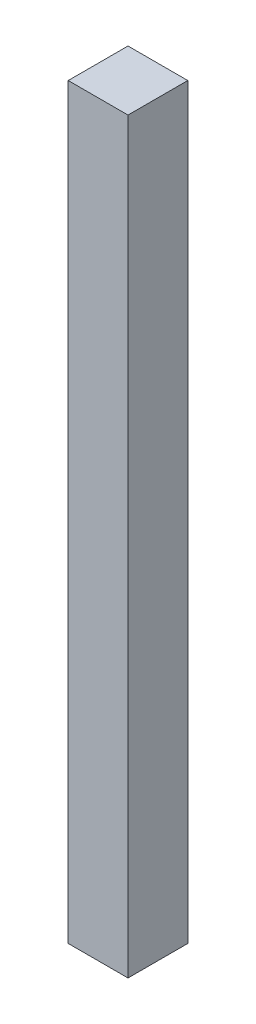
ISO-10303-21;
HEADER;
FILE_DESCRIPTION(('STEP AP214'),'2;1');
FILE_NAME('part.step','',(''),(''),'','','');
FILE_SCHEMA(('AUTOMOTIVE_DESIGN { 1 0 10303 214 1 1 1 1 }'));
ENDSEC;
DATA;
#1=APPLICATION_CONTEXT('core data for automotive mechanical design processes');
#2=APPLICATION_PROTOCOL_DEFINITION('international standard','automotive_design',2000,#1);
#3=PRODUCT_CONTEXT('',#1,'mechanical');
#4=PRODUCT('Part','Part','',(#3));
#5=PRODUCT_RELATED_PRODUCT_CATEGORY('part','',(#4));
#6=PRODUCT_DEFINITION_FORMATION('','',#4);
#7=PRODUCT_DEFINITION_CONTEXT('part definition',#1,'design');
#8=PRODUCT_DEFINITION('design','',#6,#7);
#9=PRODUCT_DEFINITION_SHAPE('','',#8);
#10=(LENGTH_UNIT() NAMED_UNIT(*) SI_UNIT(.MILLI.,.METRE.));
#11=(NAMED_UNIT(*) PLANE_ANGLE_UNIT() SI_UNIT($,.RADIAN.));
#12=(NAMED_UNIT(*) SI_UNIT($,.STERADIAN.) SOLID_ANGLE_UNIT());
#13=UNCERTAINTY_MEASURE_WITH_UNIT(LENGTH_MEASURE(1.E-05),#10,'distance_accuracy_value','');
#14=(GEOMETRIC_REPRESENTATION_CONTEXT(3) GLOBAL_UNCERTAINTY_ASSIGNED_CONTEXT((#13)) GLOBAL_UNIT_ASSIGNED_CONTEXT((#10,
#11,#12)) REPRESENTATION_CONTEXT('',''));
#15=CARTESIAN_POINT('',(0.,0.,0.));
#16=DIRECTION('',(0.,0.,1.));
#17=DIRECTION('',(1.,0.,0.));
#18=AXIS2_PLACEMENT_3D('',#15,#16,#17);
#19=CARTESIAN_POINT('',(0.2499995,3.12504582,0.));
#20=DIRECTION('',(1.,0.,0.));
#21=DIRECTION('',(0.,0.,-1.));
#22=AXIS2_PLACEMENT_3D('',#19,#20,#21);
#23=PLANE('',#22);
#24=DIRECTION('',(0.,0.,-1.));
#25=VECTOR('',#24,1.);
#26=CARTESIAN_POINT('',(0.2499995,-3.12504328,0.));
#27=LINE('',#26,#25);
#28=CARTESIAN_POINT('',(0.2499995,-3.12504328,0.));
#29=VERTEX_POINT('',#28);
#30=CARTESIAN_POINT('',(0.2499995,-3.12504328,0.499999));
#31=VERTEX_POINT('',#30);
#32=EDGE_CURVE('E20',#29,#31,#27,.F.);
#33=ORIENTED_EDGE('',*,*,#32,.F.);
#34=DIRECTION('',(0.,1.,0.));
#35=VECTOR('',#34,1.);
#36=CARTESIAN_POINT('',(0.2499995,-3.12504328,0.));
#37=LINE('',#36,#35);
#38=CARTESIAN_POINT('',(0.2499995,3.12504582,0.));
#39=VERTEX_POINT('',#38);
#40=EDGE_CURVE('E79',#29,#39,#37,.T.);
#41=ORIENTED_EDGE('',*,*,#40,.T.);
#42=DIRECTION('',(0.,0.,1.));
#43=VECTOR('',#42,1.);
#44=CARTESIAN_POINT('',(0.2499995,3.12504582,0.));
#45=LINE('',#44,#43);
#46=CARTESIAN_POINT('',(0.2499995,3.12504582,0.499999));
#47=VERTEX_POINT('',#46);
#48=EDGE_CURVE('E61',#47,#39,#45,.F.);
#49=ORIENTED_EDGE('',*,*,#48,.F.);
#50=DIRECTION('',(0.,1.,0.));
#51=VECTOR('',#50,1.);
#52=CARTESIAN_POINT('',(0.2499995,-3.12504328,0.499999));
#53=LINE('',#52,#51);
#54=EDGE_CURVE('E56',#31,#47,#53,.T.);
#55=ORIENTED_EDGE('',*,*,#54,.F.);
#56=EDGE_LOOP('',(#33,#41,#49,#55));
#57=FACE_BOUND('',#56,.T.);
#58=ADVANCED_FACE('F17',(#57),#23,.T.);
#59=CARTESIAN_POINT('',(0.2499995,-3.12504328,0.));
#60=DIRECTION('',(0.,-1.,0.));
#61=DIRECTION('',(0.,0.,-1.));
#62=AXIS2_PLACEMENT_3D('',#59,#60,#61);
#63=PLANE('',#62);
#64=DIRECTION('',(0.,0.,1.));
#65=VECTOR('',#64,1.);
#66=CARTESIAN_POINT('',(-0.2499995,-3.12504328,0.));
#67=LINE('',#66,#65);
#68=CARTESIAN_POINT('',(-0.2499995,-3.12504328,0.));
#69=VERTEX_POINT('',#68);
#70=CARTESIAN_POINT('',(-0.2499995,-3.12504328,0.499999));
#71=VERTEX_POINT('',#70);
#72=EDGE_CURVE('E83',#69,#71,#67,.T.);
#73=ORIENTED_EDGE('',*,*,#72,.F.);
#74=DIRECTION('',(1.,0.,0.));
#75=VECTOR('',#74,1.);
#76=CARTESIAN_POINT('',(0.2499995,-3.12504328,0.));
#77=LINE('',#76,#75);
#78=EDGE_CURVE('E68',#69,#29,#77,.T.);
#79=ORIENTED_EDGE('',*,*,#78,.T.);
#80=ORIENTED_EDGE('',*,*,#32,.T.);
#81=DIRECTION('',(1.,0.,0.));
#82=VECTOR('',#81,1.);
#83=CARTESIAN_POINT('',(0.2499995,-3.12504328,0.499999));
#84=LINE('',#83,#82);
#85=EDGE_CURVE('E63',#71,#31,#84,.T.);
#86=ORIENTED_EDGE('',*,*,#85,.F.);
#87=EDGE_LOOP('',(#73,#79,#80,#86));
#88=FACE_BOUND('',#87,.T.);
#89=ADVANCED_FACE('F65',(#88),#63,.T.);
#90=CARTESIAN_POINT('',(0.2499995,-3.12504328,0.499999));
#91=DIRECTION('',(0.,0.,1.));
#92=DIRECTION('',(1.,0.,0.));
#93=AXIS2_PLACEMENT_3D('',#90,#91,#92);
#94=PLANE('',#93);
#95=DIRECTION('',(0.,1.,0.));
#96=VECTOR('',#95,1.);
#97=CARTESIAN_POINT('',(-0.2499995,-3.12504328,0.499999));
#98=LINE('',#97,#96);
#99=CARTESIAN_POINT('',(-0.2499995,3.12504582,0.499999));
#100=VERTEX_POINT('',#99);
#101=EDGE_CURVE('E72',#71,#100,#98,.T.);
#102=ORIENTED_EDGE('',*,*,#101,.F.);
#103=ORIENTED_EDGE('',*,*,#85,.T.);
#104=ORIENTED_EDGE('',*,*,#54,.T.);
#105=DIRECTION('',(1.,0.,0.));
#106=VECTOR('',#105,1.);
#107=CARTESIAN_POINT('',(-0.2499995,3.12504582,0.499999));
#108=LINE('',#107,#106);
#109=EDGE_CURVE('E74',#100,#47,#108,.T.);
#110=ORIENTED_EDGE('',*,*,#109,.F.);
#111=EDGE_LOOP('',(#102,#103,#104,#110));
#112=FACE_BOUND('',#111,.T.);
#113=ADVANCED_FACE('F70',(#112),#94,.T.);
#114=CARTESIAN_POINT('',(-0.2499995,3.12504582,0.));
#115=DIRECTION('',(0.,1.,0.));
#116=DIRECTION('',(0.,0.,1.));
#117=AXIS2_PLACEMENT_3D('',#114,#115,#116);
#118=PLANE('',#117);
#119=ORIENTED_EDGE('',*,*,#48,.T.);
#120=DIRECTION('',(1.,0.,0.));
#121=VECTOR('',#120,1.);
#122=CARTESIAN_POINT('',(0.2499995,3.12504582,0.));
#123=LINE('',#122,#121);
#124=CARTESIAN_POINT('',(-0.2499995,3.12504582,0.));
#125=VERTEX_POINT('',#124);
#126=EDGE_CURVE('E35',#39,#125,#123,.F.);
#127=ORIENTED_EDGE('',*,*,#126,.T.);
#128=DIRECTION('',(0.,0.,1.));
#129=VECTOR('',#128,1.);
#130=CARTESIAN_POINT('',(-0.2499995,3.12504582,0.));
#131=LINE('',#130,#129);
#132=EDGE_CURVE('E26',#100,#125,#131,.F.);
#133=ORIENTED_EDGE('',*,*,#132,.F.);
#134=ORIENTED_EDGE('',*,*,#109,.T.);
#135=EDGE_LOOP('',(#119,#127,#133,#134));
#136=FACE_BOUND('',#135,.T.);
#137=ADVANCED_FACE('F89',(#136),#118,.T.);
#138=CARTESIAN_POINT('',(0.2499995,-3.12504328,0.));
#139=DIRECTION('',(0.,0.,1.));
#140=DIRECTION('',(1.,0.,0.));
#141=AXIS2_PLACEMENT_3D('',#138,#139,#140);
#142=PLANE('',#141);
#143=DIRECTION('',(0.,1.,0.));
#144=VECTOR('',#143,1.);
#145=CARTESIAN_POINT('',(-0.2499995,-3.12504328,0.));
#146=LINE('',#145,#144);
#147=EDGE_CURVE('E11',#125,#69,#146,.F.);
#148=ORIENTED_EDGE('',*,*,#147,.F.);
#149=ORIENTED_EDGE('',*,*,#126,.F.);
#150=ORIENTED_EDGE('',*,*,#40,.F.);
#151=ORIENTED_EDGE('',*,*,#78,.F.);
#152=EDGE_LOOP('',(#148,#149,#150,#151));
#153=FACE_BOUND('',#152,.T.);
#154=ADVANCED_FACE('F91',(#153),#142,.F.);
#155=CARTESIAN_POINT('',(-0.2499995,-3.12504328,0.));
#156=DIRECTION('',(-1.,0.,0.));
#157=DIRECTION('',(0.,0.,1.));
#158=AXIS2_PLACEMENT_3D('',#155,#156,#157);
#159=PLANE('',#158);
#160=ORIENTED_EDGE('',*,*,#132,.T.);
#161=ORIENTED_EDGE('',*,*,#147,.T.);
#162=ORIENTED_EDGE('',*,*,#72,.T.);
#163=ORIENTED_EDGE('',*,*,#101,.T.);
#164=EDGE_LOOP('',(#160,#161,#162,#163));
#165=FACE_BOUND('',#164,.T.);
#166=ADVANCED_FACE('F88',(#165),#159,.T.);
#167=CLOSED_SHELL('',(#58,#89,#113,#137,#154,#166));
#168=MANIFOLD_SOLID_BREP('B1',#167);
#169=ADVANCED_BREP_SHAPE_REPRESENTATION('',(#18,#168),#14);
#170=SHAPE_DEFINITION_REPRESENTATION(#9,#169);
ENDSEC;
END-ISO-10303-21;
